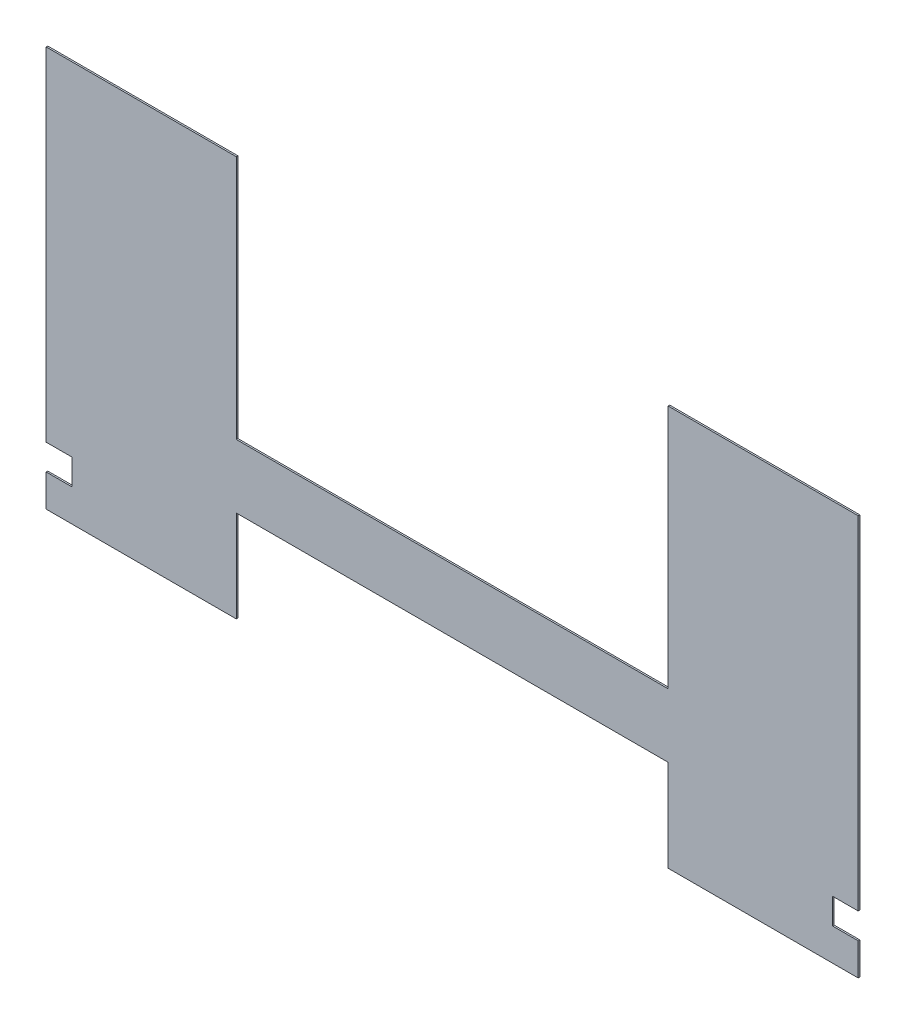
ISO-10303-21;
HEADER;
FILE_DESCRIPTION(('STEP AP214'),'2;1');
FILE_NAME('part.step','',(''),(''),'','','');
FILE_SCHEMA(('AUTOMOTIVE_DESIGN { 1 0 10303 214 1 1 1 1 }'));
ENDSEC;
DATA;
#1=APPLICATION_CONTEXT('core data for automotive mechanical design processes');
#2=APPLICATION_PROTOCOL_DEFINITION('international standard','automotive_design',2000,#1);
#3=PRODUCT_CONTEXT('',#1,'mechanical');
#4=PRODUCT('Part','Part','',(#3));
#5=PRODUCT_RELATED_PRODUCT_CATEGORY('part','',(#4));
#6=PRODUCT_DEFINITION_FORMATION('','',#4);
#7=PRODUCT_DEFINITION_CONTEXT('part definition',#1,'design');
#8=PRODUCT_DEFINITION('design','',#6,#7);
#9=PRODUCT_DEFINITION_SHAPE('','',#8);
#10=(LENGTH_UNIT() NAMED_UNIT(*) SI_UNIT(.MILLI.,.METRE.));
#11=(NAMED_UNIT(*) PLANE_ANGLE_UNIT() SI_UNIT($,.RADIAN.));
#12=(NAMED_UNIT(*) SI_UNIT($,.STERADIAN.) SOLID_ANGLE_UNIT());
#13=UNCERTAINTY_MEASURE_WITH_UNIT(LENGTH_MEASURE(1.E-05),#10,'distance_accuracy_value','');
#14=(GEOMETRIC_REPRESENTATION_CONTEXT(3) GLOBAL_UNCERTAINTY_ASSIGNED_CONTEXT((#13)) GLOBAL_UNIT_ASSIGNED_CONTEXT((#10,
#11,#12)) REPRESENTATION_CONTEXT('',''));
#15=CARTESIAN_POINT('',(0.,0.,0.));
#16=DIRECTION('',(0.,0.,1.));
#17=DIRECTION('',(1.,0.,0.));
#18=AXIS2_PLACEMENT_3D('',#15,#16,#17);
#19=CARTESIAN_POINT('',(-400.05,241.3,1.5875));
#20=DIRECTION('',(1.,0.,0.));
#21=DIRECTION('',(0.,1.,0.));
#22=AXIS2_PLACEMENT_3D('',#19,#20,#21);
#23=PLANE('',#22);
#24=DIRECTION('',(0.,-1.,0.));
#25=VECTOR('',#24,1.);
#26=CARTESIAN_POINT('',(-400.05,241.3,0.));
#27=LINE('',#26,#25);
#28=CARTESIAN_POINT('',(-400.05,241.3,0.));
#29=VERTEX_POINT('',#28);
#30=CARTESIAN_POINT('',(-400.05,-96.0119999999991,0.));
#31=VERTEX_POINT('',#30);
#32=EDGE_CURVE('E263',#29,#31,#27,.T.);
#33=ORIENTED_EDGE('',*,*,#32,.T.);
#34=DIRECTION('',(0.,0.,-1.));
#35=VECTOR('',#34,1.);
#36=CARTESIAN_POINT('',(-400.05,-96.0119999999991,1.5875));
#37=LINE('',#36,#35);
#38=CARTESIAN_POINT('',(-400.05,-96.0119999999991,1.5875));
#39=VERTEX_POINT('',#38);
#40=EDGE_CURVE('E203',#39,#31,#37,.T.);
#41=ORIENTED_EDGE('',*,*,#40,.F.);
#42=DIRECTION('',(0.,-1.,0.));
#43=VECTOR('',#42,1.);
#44=CARTESIAN_POINT('',(-400.05,241.3,1.5875));
#45=LINE('',#44,#43);
#46=CARTESIAN_POINT('',(-400.05,241.3,1.5875));
#47=VERTEX_POINT('',#46);
#48=EDGE_CURVE('E235',#47,#39,#45,.T.);
#49=ORIENTED_EDGE('',*,*,#48,.F.);
#50=DIRECTION('',(0.,0.,-1.));
#51=VECTOR('',#50,1.);
#52=CARTESIAN_POINT('',(-400.05,241.3,1.5875));
#53=LINE('',#52,#51);
#54=EDGE_CURVE('E11',#47,#29,#53,.T.);
#55=ORIENTED_EDGE('',*,*,#54,.T.);
#56=EDGE_LOOP('',(#33,#41,#49,#55));
#57=FACE_BOUND('',#56,.T.);
#58=ADVANCED_FACE('F35',(#57),#23,.F.);
#59=CARTESIAN_POINT('',(400.05,-153.162,1.5875));
#60=DIRECTION('',(-1.,0.,0.));
#61=DIRECTION('',(0.,-1.,0.));
#62=AXIS2_PLACEMENT_3D('',#59,#60,#61);
#63=PLANE('',#62);
#64=DIRECTION('',(0.,1.,0.));
#65=VECTOR('',#64,1.);
#66=CARTESIAN_POINT('',(400.05,-153.162,1.5875));
#67=LINE('',#66,#65);
#68=CARTESIAN_POINT('',(400.05,-96.012000000015,1.5875));
#69=VERTEX_POINT('',#68);
#70=CARTESIAN_POINT('',(400.05,241.3,1.5875));
#71=VERTEX_POINT('',#70);
#72=EDGE_CURVE('E247',#69,#71,#67,.T.);
#73=ORIENTED_EDGE('',*,*,#72,.F.);
#74=DIRECTION('',(0.,0.,-1.));
#75=VECTOR('',#74,1.);
#76=CARTESIAN_POINT('',(400.05,-96.012000000015,1.5875));
#77=LINE('',#76,#75);
#78=CARTESIAN_POINT('',(400.05,-96.012000000015,0.));
#79=VERTEX_POINT('',#78);
#80=EDGE_CURVE('E221',#69,#79,#77,.T.);
#81=ORIENTED_EDGE('',*,*,#80,.T.);
#82=DIRECTION('',(0.,1.,0.));
#83=VECTOR('',#82,1.);
#84=CARTESIAN_POINT('',(400.05,-153.162,0.));
#85=LINE('',#84,#83);
#86=CARTESIAN_POINT('',(400.05,241.3,0.));
#87=VERTEX_POINT('',#86);
#88=EDGE_CURVE('E276',#79,#87,#85,.T.);
#89=ORIENTED_EDGE('',*,*,#88,.T.);
#90=DIRECTION('',(0.,0.,-1.));
#91=VECTOR('',#90,1.);
#92=CARTESIAN_POINT('',(400.05,241.3,1.5875));
#93=LINE('',#92,#91);
#94=EDGE_CURVE('E298',#71,#87,#93,.T.);
#95=ORIENTED_EDGE('',*,*,#94,.F.);
#96=EDGE_LOOP('',(#73,#81,#89,#95));
#97=FACE_BOUND('',#96,.T.);
#98=ADVANCED_FACE('F348',(#97),#63,.F.);
#99=CARTESIAN_POINT('',(-212.725,241.3,1.5875));
#100=DIRECTION('',(0.,-1.,0.));
#101=DIRECTION('',(1.,0.,0.));
#102=AXIS2_PLACEMENT_3D('',#99,#100,#101);
#103=PLANE('',#102);
#104=DIRECTION('',(-1.,0.,0.));
#105=VECTOR('',#104,1.);
#106=CARTESIAN_POINT('',(-212.725,241.3,0.));
#107=LINE('',#106,#105);
#108=CARTESIAN_POINT('',(-212.725,241.3,0.));
#109=VERTEX_POINT('',#108);
#110=EDGE_CURVE('E224',#109,#29,#107,.T.);
#111=ORIENTED_EDGE('',*,*,#110,.T.);
#112=ORIENTED_EDGE('',*,*,#54,.F.);
#113=DIRECTION('',(-1.,0.,0.));
#114=VECTOR('',#113,1.);
#115=CARTESIAN_POINT('',(-212.725,241.3,1.5875));
#116=LINE('',#115,#114);
#117=CARTESIAN_POINT('',(-212.725,241.3,1.5875));
#118=VERTEX_POINT('',#117);
#119=EDGE_CURVE('E230',#118,#47,#116,.T.);
#120=ORIENTED_EDGE('',*,*,#119,.F.);
#121=DIRECTION('',(0.,0.,-1.));
#122=VECTOR('',#121,1.);
#123=CARTESIAN_POINT('',(-212.725,241.3,1.5875));
#124=LINE('',#123,#122);
#125=EDGE_CURVE('E259',#118,#109,#124,.T.);
#126=ORIENTED_EDGE('',*,*,#125,.T.);
#127=EDGE_LOOP('',(#111,#112,#120,#126));
#128=FACE_BOUND('',#127,.T.);
#129=ADVANCED_FACE('F37',(#128),#103,.F.);
#130=CARTESIAN_POINT('',(-400.05,-121.411999999999,1.5875));
#131=VERTEX_POINT('',#130);
#132=CARTESIAN_POINT('',(-400.05,-153.162,1.5875));
#133=VERTEX_POINT('',#132);
#134=EDGE_CURVE('E233',#131,#133,#45,.T.);
#135=ORIENTED_EDGE('',*,*,#134,.F.);
#136=DIRECTION('',(0.,0.,-1.));
#137=VECTOR('',#136,1.);
#138=CARTESIAN_POINT('',(-400.05,-121.411999999999,1.5875));
#139=LINE('',#138,#137);
#140=CARTESIAN_POINT('',(-400.05,-121.411999999999,0.));
#141=VERTEX_POINT('',#140);
#142=EDGE_CURVE('E179',#131,#141,#139,.T.);
#143=ORIENTED_EDGE('',*,*,#142,.T.);
#144=CARTESIAN_POINT('',(-400.05,-153.162,0.));
#145=VERTEX_POINT('',#144);
#146=EDGE_CURVE('E262',#141,#145,#27,.T.);
#147=ORIENTED_EDGE('',*,*,#146,.T.);
#148=DIRECTION('',(0.,0.,-1.));
#149=VECTOR('',#148,1.);
#150=CARTESIAN_POINT('',(-400.05,-153.162,1.5875));
#151=LINE('',#150,#149);
#152=EDGE_CURVE('E43',#133,#145,#151,.T.);
#153=ORIENTED_EDGE('',*,*,#152,.F.);
#154=EDGE_LOOP('',(#135,#143,#147,#153));
#155=FACE_BOUND('',#154,.T.);
#156=ADVANCED_FACE('F339',(#155),#23,.F.);
#157=CARTESIAN_POINT('',(-400.05,-153.162,1.5875));
#158=DIRECTION('',(0.,1.,0.));
#159=DIRECTION('',(0.,0.,1.));
#160=AXIS2_PLACEMENT_3D('',#157,#158,#159);
#161=PLANE('',#160);
#162=DIRECTION('',(1.,0.,0.));
#163=VECTOR('',#162,1.);
#164=CARTESIAN_POINT('',(-400.05,-153.162,0.));
#165=LINE('',#164,#163);
#166=CARTESIAN_POINT('',(-212.725,-153.162,0.));
#167=VERTEX_POINT('',#166);
#168=EDGE_CURVE('E266',#145,#167,#165,.T.);
#169=ORIENTED_EDGE('',*,*,#168,.T.);
#170=DIRECTION('',(0.,0.,-1.));
#171=VECTOR('',#170,1.);
#172=CARTESIAN_POINT('',(-212.725,-153.162,1.5875));
#173=LINE('',#172,#171);
#174=CARTESIAN_POINT('',(-212.725,-153.162,1.5875));
#175=VERTEX_POINT('',#174);
#176=EDGE_CURVE('E313',#175,#167,#173,.T.);
#177=ORIENTED_EDGE('',*,*,#176,.F.);
#178=DIRECTION('',(1.,0.,0.));
#179=VECTOR('',#178,1.);
#180=CARTESIAN_POINT('',(-400.05,-153.162,1.5875));
#181=LINE('',#180,#179);
#182=EDGE_CURVE('E237',#133,#175,#181,.T.);
#183=ORIENTED_EDGE('',*,*,#182,.F.);
#184=ORIENTED_EDGE('',*,*,#152,.T.);
#185=EDGE_LOOP('',(#169,#177,#183,#184));
#186=FACE_BOUND('',#185,.T.);
#187=ADVANCED_FACE('F320',(#186),#161,.F.);
#188=CARTESIAN_POINT('',(-212.725,-153.162,1.5875));
#189=DIRECTION('',(-1.,0.,0.));
#190=DIRECTION('',(0.,-1.,0.));
#191=AXIS2_PLACEMENT_3D('',#188,#189,#190);
#192=PLANE('',#191);
#193=DIRECTION('',(0.,1.,0.));
#194=VECTOR('',#193,1.);
#195=CARTESIAN_POINT('',(-212.725,-153.162,0.));
#196=LINE('',#195,#194);
#197=CARTESIAN_POINT('',(-212.725,-62.738,0.));
#198=VERTEX_POINT('',#197);
#199=EDGE_CURVE('E268',#167,#198,#196,.T.);
#200=ORIENTED_EDGE('',*,*,#199,.T.);
#201=DIRECTION('',(0.,0.,-1.));
#202=VECTOR('',#201,1.);
#203=CARTESIAN_POINT('',(-212.725,-62.738,1.5875));
#204=LINE('',#203,#202);
#205=CARTESIAN_POINT('',(-212.725,-62.738,1.5875));
#206=VERTEX_POINT('',#205);
#207=EDGE_CURVE('E310',#206,#198,#204,.T.);
#208=ORIENTED_EDGE('',*,*,#207,.F.);
#209=DIRECTION('',(0.,1.,0.));
#210=VECTOR('',#209,1.);
#211=CARTESIAN_POINT('',(-212.725,-153.162,1.5875));
#212=LINE('',#211,#210);
#213=EDGE_CURVE('E239',#175,#206,#212,.T.);
#214=ORIENTED_EDGE('',*,*,#213,.F.);
#215=ORIENTED_EDGE('',*,*,#176,.T.);
#216=EDGE_LOOP('',(#200,#208,#214,#215));
#217=FACE_BOUND('',#216,.T.);
#218=ADVANCED_FACE('F331',(#217),#192,.F.);
#219=CARTESIAN_POINT('',(-212.725,-62.738,1.5875));
#220=DIRECTION('',(0.,1.,0.));
#221=DIRECTION('',(0.,0.,1.));
#222=AXIS2_PLACEMENT_3D('',#219,#220,#221);
#223=PLANE('',#222);
#224=DIRECTION('',(1.,0.,0.));
#225=VECTOR('',#224,1.);
#226=CARTESIAN_POINT('',(-212.725,-62.738,0.));
#227=LINE('',#226,#225);
#228=CARTESIAN_POINT('',(212.725,-62.738,0.));
#229=VERTEX_POINT('',#228);
#230=EDGE_CURVE('E270',#198,#229,#227,.T.);
#231=ORIENTED_EDGE('',*,*,#230,.T.);
#232=DIRECTION('',(0.,0.,-1.));
#233=VECTOR('',#232,1.);
#234=CARTESIAN_POINT('',(212.725,-62.738,1.5875));
#235=LINE('',#234,#233);
#236=CARTESIAN_POINT('',(212.725,-62.738,1.5875));
#237=VERTEX_POINT('',#236);
#238=EDGE_CURVE('E307',#237,#229,#235,.T.);
#239=ORIENTED_EDGE('',*,*,#238,.F.);
#240=DIRECTION('',(1.,0.,0.));
#241=VECTOR('',#240,1.);
#242=CARTESIAN_POINT('',(-212.725,-62.738,1.5875));
#243=LINE('',#242,#241);
#244=EDGE_CURVE('E241',#206,#237,#243,.T.);
#245=ORIENTED_EDGE('',*,*,#244,.F.);
#246=ORIENTED_EDGE('',*,*,#207,.T.);
#247=EDGE_LOOP('',(#231,#239,#245,#246));
#248=FACE_BOUND('',#247,.T.);
#249=ADVANCED_FACE('F335',(#248),#223,.F.);
#250=CARTESIAN_POINT('',(212.725,-62.738,1.5875));
#251=DIRECTION('',(1.,0.,0.));
#252=DIRECTION('',(0.,1.,0.));
#253=AXIS2_PLACEMENT_3D('',#250,#251,#252);
#254=PLANE('',#253);
#255=DIRECTION('',(0.,-1.,0.));
#256=VECTOR('',#255,1.);
#257=CARTESIAN_POINT('',(212.725,-62.738,0.));
#258=LINE('',#257,#256);
#259=CARTESIAN_POINT('',(212.725,-153.162,0.));
#260=VERTEX_POINT('',#259);
#261=EDGE_CURVE('E272',#229,#260,#258,.T.);
#262=ORIENTED_EDGE('',*,*,#261,.T.);
#263=DIRECTION('',(0.,0.,-1.));
#264=VECTOR('',#263,1.);
#265=CARTESIAN_POINT('',(212.725,-153.162,1.5875));
#266=LINE('',#265,#264);
#267=CARTESIAN_POINT('',(212.725,-153.162,1.5875));
#268=VERTEX_POINT('',#267);
#269=EDGE_CURVE('E304',#268,#260,#266,.T.);
#270=ORIENTED_EDGE('',*,*,#269,.F.);
#271=DIRECTION('',(0.,-1.,0.));
#272=VECTOR('',#271,1.);
#273=CARTESIAN_POINT('',(212.725,-62.738,1.5875));
#274=LINE('',#273,#272);
#275=EDGE_CURVE('E243',#237,#268,#274,.T.);
#276=ORIENTED_EDGE('',*,*,#275,.F.);
#277=ORIENTED_EDGE('',*,*,#238,.T.);
#278=EDGE_LOOP('',(#262,#270,#276,#277));
#279=FACE_BOUND('',#278,.T.);
#280=ADVANCED_FACE('F409',(#279),#254,.F.);
#281=CARTESIAN_POINT('',(212.725,-153.162,1.5875));
#282=DIRECTION('',(0.,1.,0.));
#283=DIRECTION('',(0.,0.,1.));
#284=AXIS2_PLACEMENT_3D('',#281,#282,#283);
#285=PLANE('',#284);
#286=DIRECTION('',(1.,0.,0.));
#287=VECTOR('',#286,1.);
#288=CARTESIAN_POINT('',(212.725,-153.162,0.));
#289=LINE('',#288,#287);
#290=CARTESIAN_POINT('',(400.05,-153.162,0.));
#291=VERTEX_POINT('',#290);
#292=EDGE_CURVE('E274',#260,#291,#289,.T.);
#293=ORIENTED_EDGE('',*,*,#292,.T.);
#294=DIRECTION('',(0.,0.,-1.));
#295=VECTOR('',#294,1.);
#296=CARTESIAN_POINT('',(400.05,-153.162,1.5875));
#297=LINE('',#296,#295);
#298=CARTESIAN_POINT('',(400.05,-153.162,1.5875));
#299=VERTEX_POINT('',#298);
#300=EDGE_CURVE('E301',#299,#291,#297,.T.);
#301=ORIENTED_EDGE('',*,*,#300,.F.);
#302=DIRECTION('',(1.,0.,0.));
#303=VECTOR('',#302,1.);
#304=CARTESIAN_POINT('',(212.725,-153.162,1.5875));
#305=LINE('',#304,#303);
#306=EDGE_CURVE('E245',#268,#299,#305,.T.);
#307=ORIENTED_EDGE('',*,*,#306,.F.);
#308=ORIENTED_EDGE('',*,*,#269,.T.);
#309=EDGE_LOOP('',(#293,#301,#307,#308));
#310=FACE_BOUND('',#309,.T.);
#311=ADVANCED_FACE('F405',(#310),#285,.F.);
#312=CARTESIAN_POINT('',(400.05,-121.412000000015,0.));
#313=VERTEX_POINT('',#312);
#314=EDGE_CURVE('E277',#291,#313,#85,.T.);
#315=ORIENTED_EDGE('',*,*,#314,.T.);
#316=DIRECTION('',(0.,0.,-1.));
#317=VECTOR('',#316,1.);
#318=CARTESIAN_POINT('',(400.05,-121.412000000015,1.5875));
#319=LINE('',#318,#317);
#320=CARTESIAN_POINT('',(400.05,-121.412000000015,1.5875));
#321=VERTEX_POINT('',#320);
#322=EDGE_CURVE('E58',#321,#313,#319,.T.);
#323=ORIENTED_EDGE('',*,*,#322,.F.);
#324=EDGE_CURVE('E248',#299,#321,#67,.T.);
#325=ORIENTED_EDGE('',*,*,#324,.F.);
#326=ORIENTED_EDGE('',*,*,#300,.T.);
#327=EDGE_LOOP('',(#315,#323,#325,#326));
#328=FACE_BOUND('',#327,.T.);
#329=ADVANCED_FACE('F357',(#328),#63,.F.);
#330=CARTESIAN_POINT('',(400.05,241.3,1.5875));
#331=DIRECTION('',(0.,-1.,0.));
#332=DIRECTION('',(1.,0.,0.));
#333=AXIS2_PLACEMENT_3D('',#330,#331,#332);
#334=PLANE('',#333);
#335=DIRECTION('',(-1.,0.,0.));
#336=VECTOR('',#335,1.);
#337=CARTESIAN_POINT('',(400.05,241.3,0.));
#338=LINE('',#337,#336);
#339=CARTESIAN_POINT('',(212.725,241.3,0.));
#340=VERTEX_POINT('',#339);
#341=EDGE_CURVE('E280',#87,#340,#338,.T.);
#342=ORIENTED_EDGE('',*,*,#341,.T.);
#343=DIRECTION('',(0.,0.,-1.));
#344=VECTOR('',#343,1.);
#345=CARTESIAN_POINT('',(212.725,241.3,1.5875));
#346=LINE('',#345,#344);
#347=CARTESIAN_POINT('',(212.725,241.3,1.5875));
#348=VERTEX_POINT('',#347);
#349=EDGE_CURVE('E295',#348,#340,#346,.T.);
#350=ORIENTED_EDGE('',*,*,#349,.F.);
#351=DIRECTION('',(-1.,0.,0.));
#352=VECTOR('',#351,1.);
#353=CARTESIAN_POINT('',(400.05,241.3,1.5875));
#354=LINE('',#353,#352);
#355=EDGE_CURVE('E251',#71,#348,#354,.T.);
#356=ORIENTED_EDGE('',*,*,#355,.F.);
#357=ORIENTED_EDGE('',*,*,#94,.T.);
#358=EDGE_LOOP('',(#342,#350,#356,#357));
#359=FACE_BOUND('',#358,.T.);
#360=ADVANCED_FACE('F399',(#359),#334,.F.);
#361=CARTESIAN_POINT('',(212.725,241.3,1.5875));
#362=DIRECTION('',(1.,0.,0.));
#363=DIRECTION('',(0.,1.,0.));
#364=AXIS2_PLACEMENT_3D('',#361,#362,#363);
#365=PLANE('',#364);
#366=DIRECTION('',(0.,-1.,0.));
#367=VECTOR('',#366,1.);
#368=CARTESIAN_POINT('',(212.725,241.3,0.));
#369=LINE('',#368,#367);
#370=CARTESIAN_POINT('',(212.725,0.,0.));
#371=VERTEX_POINT('',#370);
#372=EDGE_CURVE('E282',#340,#371,#369,.T.);
#373=ORIENTED_EDGE('',*,*,#372,.T.);
#374=DIRECTION('',(0.,0.,-1.));
#375=VECTOR('',#374,1.);
#376=CARTESIAN_POINT('',(212.725,0.,1.5875));
#377=LINE('',#376,#375);
#378=CARTESIAN_POINT('',(212.725,0.,1.5875));
#379=VERTEX_POINT('',#378);
#380=EDGE_CURVE('E292',#379,#371,#377,.T.);
#381=ORIENTED_EDGE('',*,*,#380,.F.);
#382=DIRECTION('',(0.,-1.,0.));
#383=VECTOR('',#382,1.);
#384=CARTESIAN_POINT('',(212.725,241.3,1.5875));
#385=LINE('',#384,#383);
#386=EDGE_CURVE('E253',#348,#379,#385,.T.);
#387=ORIENTED_EDGE('',*,*,#386,.F.);
#388=ORIENTED_EDGE('',*,*,#349,.T.);
#389=EDGE_LOOP('',(#373,#381,#387,#388));
#390=FACE_BOUND('',#389,.T.);
#391=ADVANCED_FACE('F395',(#390),#365,.F.);
#392=CARTESIAN_POINT('',(212.725,0.,1.5875));
#393=DIRECTION('',(0.,-1.,0.));
#394=DIRECTION('',(0.,0.,-1.));
#395=AXIS2_PLACEMENT_3D('',#392,#393,#394);
#396=PLANE('',#395);
#397=DIRECTION('',(-1.,0.,0.));
#398=VECTOR('',#397,1.);
#399=CARTESIAN_POINT('',(212.725,0.,0.));
#400=LINE('',#399,#398);
#401=CARTESIAN_POINT('',(-212.725,0.,0.));
#402=VERTEX_POINT('',#401);
#403=EDGE_CURVE('E284',#371,#402,#400,.T.);
#404=ORIENTED_EDGE('',*,*,#403,.T.);
#405=DIRECTION('',(0.,0.,-1.));
#406=VECTOR('',#405,1.);
#407=CARTESIAN_POINT('',(-212.725,0.,1.5875));
#408=LINE('',#407,#406);
#409=CARTESIAN_POINT('',(-212.725,0.,1.5875));
#410=VERTEX_POINT('',#409);
#411=EDGE_CURVE('E289',#410,#402,#408,.T.);
#412=ORIENTED_EDGE('',*,*,#411,.F.);
#413=DIRECTION('',(-1.,0.,0.));
#414=VECTOR('',#413,1.);
#415=CARTESIAN_POINT('',(212.725,0.,1.5875));
#416=LINE('',#415,#414);
#417=EDGE_CURVE('E255',#379,#410,#416,.T.);
#418=ORIENTED_EDGE('',*,*,#417,.F.);
#419=ORIENTED_EDGE('',*,*,#380,.T.);
#420=EDGE_LOOP('',(#404,#412,#418,#419));
#421=FACE_BOUND('',#420,.T.);
#422=ADVANCED_FACE('F391',(#421),#396,.F.);
#423=CARTESIAN_POINT('',(-212.725,0.,1.5875));
#424=DIRECTION('',(-1.,0.,0.));
#425=DIRECTION('',(0.,-1.,0.));
#426=AXIS2_PLACEMENT_3D('',#423,#424,#425);
#427=PLANE('',#426);
#428=DIRECTION('',(0.,1.,0.));
#429=VECTOR('',#428,1.);
#430=CARTESIAN_POINT('',(-212.725,0.,0.));
#431=LINE('',#430,#429);
#432=EDGE_CURVE('E234',#402,#109,#431,.T.);
#433=ORIENTED_EDGE('',*,*,#432,.T.);
#434=ORIENTED_EDGE('',*,*,#125,.F.);
#435=DIRECTION('',(0.,1.,0.));
#436=VECTOR('',#435,1.);
#437=CARTESIAN_POINT('',(-212.725,0.,1.5875));
#438=LINE('',#437,#436);
#439=EDGE_CURVE('E257',#410,#118,#438,.T.);
#440=ORIENTED_EDGE('',*,*,#439,.F.);
#441=ORIENTED_EDGE('',*,*,#411,.T.);
#442=EDGE_LOOP('',(#433,#434,#440,#441));
#443=FACE_BOUND('',#442,.T.);
#444=ADVANCED_FACE('F386',(#443),#427,.F.);
#445=CARTESIAN_POINT('',(0.,0.,1.5875));
#446=DIRECTION('',(0.,0.,1.));
#447=DIRECTION('',(1.,0.,0.));
#448=AXIS2_PLACEMENT_3D('',#445,#446,#447);
#449=PLANE('',#448);
#450=DIRECTION('',(1.,0.,0.));
#451=VECTOR('',#450,1.);
#452=CARTESIAN_POINT('',(-400.05,-96.0119999999991,1.5875));
#453=LINE('',#452,#451);
#454=CARTESIAN_POINT('',(-374.65,-96.0119999999991,1.5875));
#455=VERTEX_POINT('',#454);
#456=EDGE_CURVE('E180',#39,#455,#453,.T.);
#457=ORIENTED_EDGE('',*,*,#456,.T.);
#458=DIRECTION('',(0.,-1.,0.));
#459=VECTOR('',#458,1.);
#460=CARTESIAN_POINT('',(-374.65,-121.411999999999,1.5875));
#461=LINE('',#460,#459);
#462=CARTESIAN_POINT('',(-374.65,-121.411999999999,1.5875));
#463=VERTEX_POINT('',#462);
#464=EDGE_CURVE('E175',#455,#463,#461,.T.);
#465=ORIENTED_EDGE('',*,*,#464,.T.);
#466=DIRECTION('',(-1.,0.,0.));
#467=VECTOR('',#466,1.);
#468=CARTESIAN_POINT('',(-400.05,-121.411999999999,1.5875));
#469=LINE('',#468,#467);
#470=EDGE_CURVE('E183',#463,#131,#469,.T.);
#471=ORIENTED_EDGE('',*,*,#470,.T.);
#472=ORIENTED_EDGE('',*,*,#134,.T.);
#473=ORIENTED_EDGE('',*,*,#182,.T.);
#474=ORIENTED_EDGE('',*,*,#213,.T.);
#475=ORIENTED_EDGE('',*,*,#244,.T.);
#476=ORIENTED_EDGE('',*,*,#275,.T.);
#477=ORIENTED_EDGE('',*,*,#306,.T.);
#478=ORIENTED_EDGE('',*,*,#324,.T.);
#479=DIRECTION('',(-1.,0.,0.));
#480=VECTOR('',#479,1.);
#481=CARTESIAN_POINT('',(374.65,-121.412000000015,1.5875));
#482=LINE('',#481,#480);
#483=CARTESIAN_POINT('',(374.65,-121.412000000015,1.5875));
#484=VERTEX_POINT('',#483);
#485=EDGE_CURVE('E206',#321,#484,#482,.T.);
#486=ORIENTED_EDGE('',*,*,#485,.T.);
#487=DIRECTION('',(0.,1.,0.));
#488=VECTOR('',#487,1.);
#489=CARTESIAN_POINT('',(374.65,-121.412000000015,1.5875));
#490=LINE('',#489,#488);
#491=CARTESIAN_POINT('',(374.65,-96.012000000015,1.5875));
#492=VERTEX_POINT('',#491);
#493=EDGE_CURVE('E209',#484,#492,#490,.T.);
#494=ORIENTED_EDGE('',*,*,#493,.T.);
#495=DIRECTION('',(1.,0.,0.));
#496=VECTOR('',#495,1.);
#497=CARTESIAN_POINT('',(374.65,-96.012000000015,1.5875));
#498=LINE('',#497,#496);
#499=EDGE_CURVE('E213',#492,#69,#498,.T.);
#500=ORIENTED_EDGE('',*,*,#499,.T.);
#501=ORIENTED_EDGE('',*,*,#72,.T.);
#502=ORIENTED_EDGE('',*,*,#355,.T.);
#503=ORIENTED_EDGE('',*,*,#386,.T.);
#504=ORIENTED_EDGE('',*,*,#417,.T.);
#505=ORIENTED_EDGE('',*,*,#439,.T.);
#506=ORIENTED_EDGE('',*,*,#119,.T.);
#507=ORIENTED_EDGE('',*,*,#48,.T.);
#508=EDGE_LOOP('',(#457,#465,#471,#472,#473,#474,#475,#476,#477,#478,#486,#494,#500,#501,#502,
#503,#504,#505,#506,#507));
#509=FACE_BOUND('',#508,.T.);
#510=ADVANCED_FACE('F189',(#509),#449,.T.);
#511=CARTESIAN_POINT('',(0.,0.,0.));
#512=DIRECTION('',(0.,0.,1.));
#513=DIRECTION('',(1.,0.,0.));
#514=AXIS2_PLACEMENT_3D('',#511,#512,#513);
#515=PLANE('',#514);
#516=DIRECTION('',(0.,-1.,0.));
#517=VECTOR('',#516,1.);
#518=CARTESIAN_POINT('',(-374.65,-121.411999999999,0.));
#519=LINE('',#518,#517);
#520=CARTESIAN_POINT('',(-374.65,-96.0119999999991,0.));
#521=VERTEX_POINT('',#520);
#522=CARTESIAN_POINT('',(-374.65,-121.411999999999,0.));
#523=VERTEX_POINT('',#522);
#524=EDGE_CURVE('E50',#521,#523,#519,.T.);
#525=ORIENTED_EDGE('',*,*,#524,.F.);
#526=DIRECTION('',(1.,0.,0.));
#527=VECTOR('',#526,1.);
#528=CARTESIAN_POINT('',(-400.05,-96.0119999999991,0.));
#529=LINE('',#528,#527);
#530=EDGE_CURVE('E191',#31,#521,#529,.T.);
#531=ORIENTED_EDGE('',*,*,#530,.F.);
#532=ORIENTED_EDGE('',*,*,#32,.F.);
#533=ORIENTED_EDGE('',*,*,#110,.F.);
#534=ORIENTED_EDGE('',*,*,#432,.F.);
#535=ORIENTED_EDGE('',*,*,#403,.F.);
#536=ORIENTED_EDGE('',*,*,#372,.F.);
#537=ORIENTED_EDGE('',*,*,#341,.F.);
#538=ORIENTED_EDGE('',*,*,#88,.F.);
#539=DIRECTION('',(1.,0.,0.));
#540=VECTOR('',#539,1.);
#541=CARTESIAN_POINT('',(374.65,-96.012000000015,0.));
#542=LINE('',#541,#540);
#543=CARTESIAN_POINT('',(374.65,-96.012000000015,0.));
#544=VERTEX_POINT('',#543);
#545=EDGE_CURVE('E210',#544,#79,#542,.T.);
#546=ORIENTED_EDGE('',*,*,#545,.F.);
#547=DIRECTION('',(0.,1.,0.));
#548=VECTOR('',#547,1.);
#549=CARTESIAN_POINT('',(374.65,-121.412000000015,0.));
#550=LINE('',#549,#548);
#551=CARTESIAN_POINT('',(374.65,-121.412000000015,0.));
#552=VERTEX_POINT('',#551);
#553=EDGE_CURVE('E217',#552,#544,#550,.T.);
#554=ORIENTED_EDGE('',*,*,#553,.F.);
#555=DIRECTION('',(-1.,0.,0.));
#556=VECTOR('',#555,1.);
#557=CARTESIAN_POINT('',(374.65,-121.412000000015,0.));
#558=LINE('',#557,#556);
#559=EDGE_CURVE('E202',#313,#552,#558,.T.);
#560=ORIENTED_EDGE('',*,*,#559,.F.);
#561=ORIENTED_EDGE('',*,*,#314,.F.);
#562=ORIENTED_EDGE('',*,*,#292,.F.);
#563=ORIENTED_EDGE('',*,*,#261,.F.);
#564=ORIENTED_EDGE('',*,*,#230,.F.);
#565=ORIENTED_EDGE('',*,*,#199,.F.);
#566=ORIENTED_EDGE('',*,*,#168,.F.);
#567=ORIENTED_EDGE('',*,*,#146,.F.);
#568=DIRECTION('',(-1.,0.,0.));
#569=VECTOR('',#568,1.);
#570=CARTESIAN_POINT('',(-400.05,-121.411999999999,0.));
#571=LINE('',#570,#569);
#572=EDGE_CURVE('E194',#523,#141,#571,.T.);
#573=ORIENTED_EDGE('',*,*,#572,.F.);
#574=EDGE_LOOP('',(#525,#531,#532,#533,#534,#535,#536,#537,#538,#546,#554,#560,#561,#562,#563,
#564,#565,#566,#567,#573));
#575=FACE_BOUND('',#574,.T.);
#576=ADVANCED_FACE('F326',(#575),#515,.F.);
#577=CARTESIAN_POINT('',(374.65,-96.012000000015,1.5875));
#578=DIRECTION('',(0.,1.,0.));
#579=DIRECTION('',(0.,0.,1.));
#580=AXIS2_PLACEMENT_3D('',#577,#578,#579);
#581=PLANE('',#580);
#582=ORIENTED_EDGE('',*,*,#545,.T.);
#583=ORIENTED_EDGE('',*,*,#80,.F.);
#584=ORIENTED_EDGE('',*,*,#499,.F.);
#585=DIRECTION('',(0.,0.,-1.));
#586=VECTOR('',#585,1.);
#587=CARTESIAN_POINT('',(374.65,-96.012000000015,1.5875));
#588=LINE('',#587,#586);
#589=EDGE_CURVE('E225',#492,#544,#588,.T.);
#590=ORIENTED_EDGE('',*,*,#589,.T.);
#591=EDGE_LOOP('',(#582,#583,#584,#590));
#592=FACE_BOUND('',#591,.T.);
#593=ADVANCED_FACE('F375',(#592),#581,.F.);
#594=CARTESIAN_POINT('',(374.65,-121.412000000015,1.5875));
#595=DIRECTION('',(-1.,0.,0.));
#596=DIRECTION('',(0.,0.,1.));
#597=AXIS2_PLACEMENT_3D('',#594,#595,#596);
#598=PLANE('',#597);
#599=ORIENTED_EDGE('',*,*,#553,.T.);
#600=ORIENTED_EDGE('',*,*,#589,.F.);
#601=ORIENTED_EDGE('',*,*,#493,.F.);
#602=DIRECTION('',(0.,0.,-1.));
#603=VECTOR('',#602,1.);
#604=CARTESIAN_POINT('',(374.65,-121.412000000015,1.5875));
#605=LINE('',#604,#603);
#606=EDGE_CURVE('E227',#484,#552,#605,.T.);
#607=ORIENTED_EDGE('',*,*,#606,.T.);
#608=EDGE_LOOP('',(#599,#600,#601,#607));
#609=FACE_BOUND('',#608,.T.);
#610=ADVANCED_FACE('F378',(#609),#598,.F.);
#611=CARTESIAN_POINT('',(374.65,-121.412000000015,1.5875));
#612=DIRECTION('',(0.,-1.,0.));
#613=DIRECTION('',(1.,0.,0.));
#614=AXIS2_PLACEMENT_3D('',#611,#612,#613);
#615=PLANE('',#614);
#616=ORIENTED_EDGE('',*,*,#559,.T.);
#617=ORIENTED_EDGE('',*,*,#606,.F.);
#618=ORIENTED_EDGE('',*,*,#485,.F.);
#619=ORIENTED_EDGE('',*,*,#322,.T.);
#620=EDGE_LOOP('',(#616,#617,#618,#619));
#621=FACE_BOUND('',#620,.T.);
#622=ADVANCED_FACE('F372',(#621),#615,.F.);
#623=CARTESIAN_POINT('',(-374.65,-121.411999999999,1.5875));
#624=DIRECTION('',(1.,0.,0.));
#625=DIRECTION('',(0.,1.,0.));
#626=AXIS2_PLACEMENT_3D('',#623,#624,#625);
#627=PLANE('',#626);
#628=ORIENTED_EDGE('',*,*,#524,.T.);
#629=DIRECTION('',(0.,0.,-1.));
#630=VECTOR('',#629,1.);
#631=CARTESIAN_POINT('',(-374.65,-121.411999999999,1.5875));
#632=LINE('',#631,#630);
#633=EDGE_CURVE('E171',#463,#523,#632,.T.);
#634=ORIENTED_EDGE('',*,*,#633,.F.);
#635=ORIENTED_EDGE('',*,*,#464,.F.);
#636=DIRECTION('',(0.,0.,-1.));
#637=VECTOR('',#636,1.);
#638=CARTESIAN_POINT('',(-374.65,-96.0119999999991,1.5875));
#639=LINE('',#638,#637);
#640=EDGE_CURVE('E200',#455,#521,#639,.T.);
#641=ORIENTED_EDGE('',*,*,#640,.T.);
#642=EDGE_LOOP('',(#628,#634,#635,#641));
#643=FACE_BOUND('',#642,.T.);
#644=ADVANCED_FACE('F173',(#643),#627,.F.);
#645=CARTESIAN_POINT('',(-400.05,-96.0119999999991,1.5875));
#646=DIRECTION('',(0.,1.,0.));
#647=DIRECTION('',(-1.,0.,0.));
#648=AXIS2_PLACEMENT_3D('',#645,#646,#647);
#649=PLANE('',#648);
#650=ORIENTED_EDGE('',*,*,#530,.T.);
#651=ORIENTED_EDGE('',*,*,#640,.F.);
#652=ORIENTED_EDGE('',*,*,#456,.F.);
#653=ORIENTED_EDGE('',*,*,#40,.T.);
#654=EDGE_LOOP('',(#650,#651,#652,#653));
#655=FACE_BOUND('',#654,.T.);
#656=ADVANCED_FACE('F364',(#655),#649,.F.);
#657=CARTESIAN_POINT('',(-400.05,-121.411999999999,1.5875));
#658=DIRECTION('',(0.,-1.,0.));
#659=DIRECTION('',(0.,0.,-1.));
#660=AXIS2_PLACEMENT_3D('',#657,#658,#659);
#661=PLANE('',#660);
#662=ORIENTED_EDGE('',*,*,#572,.T.);
#663=ORIENTED_EDGE('',*,*,#142,.F.);
#664=ORIENTED_EDGE('',*,*,#470,.F.);
#665=ORIENTED_EDGE('',*,*,#633,.T.);
#666=EDGE_LOOP('',(#662,#663,#664,#665));
#667=FACE_BOUND('',#666,.T.);
#668=ADVANCED_FACE('F184',(#667),#661,.F.);
#669=CLOSED_SHELL('',(#58,#98,#129,#156,#187,#218,#249,#280,#311,#329,#360,#391,#422,#444,#510,
#576,#593,#610,#622,#644,#656,#668));
#670=MANIFOLD_SOLID_BREP('B2',#669);
#671=ADVANCED_BREP_SHAPE_REPRESENTATION('',(#18,#670),#14);
#672=SHAPE_DEFINITION_REPRESENTATION(#9,#671);
ENDSEC;
END-ISO-10303-21;
